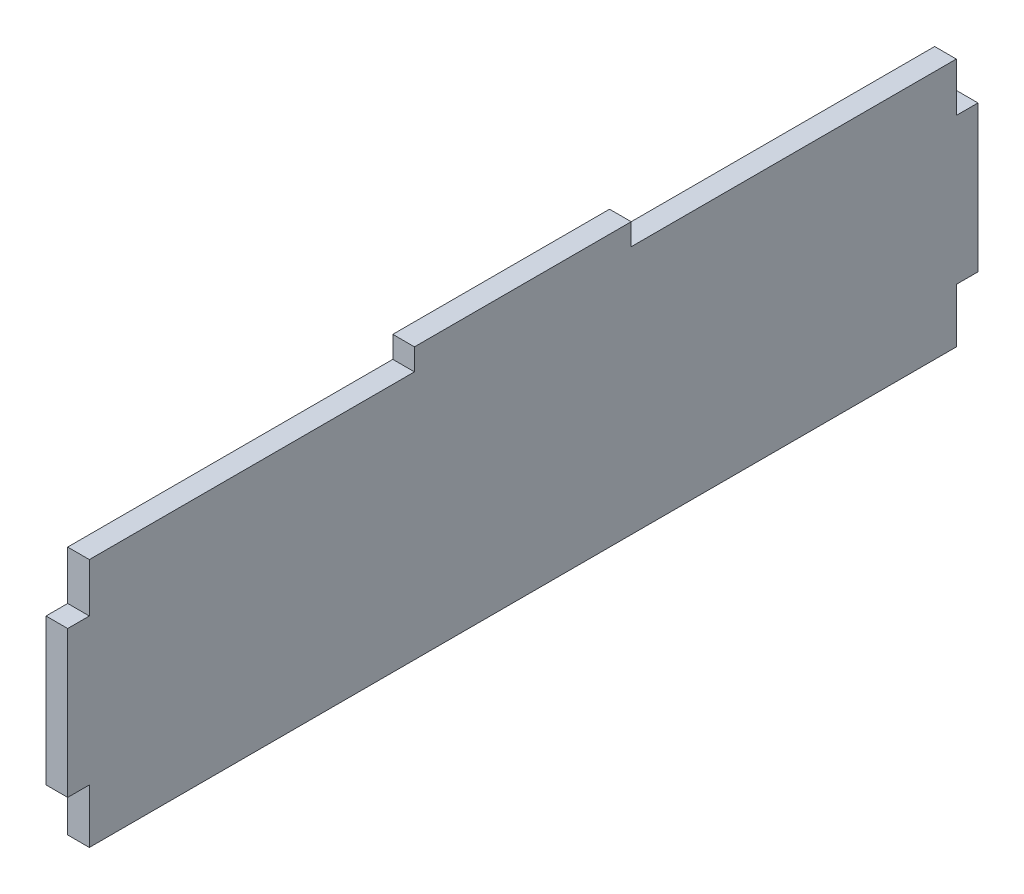
ISO-10303-21;
HEADER;
FILE_DESCRIPTION(('STEP AP214'),'2;1');
FILE_NAME('part.step','',(''),(''),'','','');
FILE_SCHEMA(('AUTOMOTIVE_DESIGN { 1 0 10303 214 1 1 1 1 }'));
ENDSEC;
DATA;
#1=APPLICATION_CONTEXT('core data for automotive mechanical design processes');
#2=APPLICATION_PROTOCOL_DEFINITION('international standard','automotive_design',2000,#1);
#3=PRODUCT_CONTEXT('',#1,'mechanical');
#4=PRODUCT('Part','Part','',(#3));
#5=PRODUCT_RELATED_PRODUCT_CATEGORY('part','',(#4));
#6=PRODUCT_DEFINITION_FORMATION('','',#4);
#7=PRODUCT_DEFINITION_CONTEXT('part definition',#1,'design');
#8=PRODUCT_DEFINITION('design','',#6,#7);
#9=PRODUCT_DEFINITION_SHAPE('','',#8);
#10=(LENGTH_UNIT() NAMED_UNIT(*) SI_UNIT(.MILLI.,.METRE.));
#11=(NAMED_UNIT(*) PLANE_ANGLE_UNIT() SI_UNIT($,.RADIAN.));
#12=(NAMED_UNIT(*) SI_UNIT($,.STERADIAN.) SOLID_ANGLE_UNIT());
#13=UNCERTAINTY_MEASURE_WITH_UNIT(LENGTH_MEASURE(1.E-05),#10,'distance_accuracy_value','');
#14=(GEOMETRIC_REPRESENTATION_CONTEXT(3) GLOBAL_UNCERTAINTY_ASSIGNED_CONTEXT((#13)) GLOBAL_UNIT_ASSIGNED_CONTEXT((#10,
#11,#12)) REPRESENTATION_CONTEXT('',''));
#15=CARTESIAN_POINT('',(0.,0.,0.));
#16=DIRECTION('',(0.,0.,1.));
#17=DIRECTION('',(1.,0.,0.));
#18=AXIS2_PLACEMENT_3D('',#15,#16,#17);
#19=CARTESIAN_POINT('',(4.,-0.984599978801032,-1.));
#20=DIRECTION('',(0.,0.,-1.));
#21=DIRECTION('',(0.,1.,0.));
#22=AXIS2_PLACEMENT_3D('',#19,#20,#21);
#23=PLANE('',#22);
#24=DIRECTION('',(0.,-1.,0.));
#25=VECTOR('',#24,1.);
#26=CARTESIAN_POINT('',(0.,-0.984599978801032,-1.));
#27=LINE('',#26,#25);
#28=CARTESIAN_POINT('',(0.,-0.984599978801032,-1.));
#29=VERTEX_POINT('',#28);
#30=CARTESIAN_POINT('',(0.,-10.,-1.));
#31=VERTEX_POINT('',#30);
#32=EDGE_CURVE('E198',#29,#31,#27,.T.);
#33=ORIENTED_EDGE('',*,*,#32,.T.);
#34=DIRECTION('',(-1.,0.,0.));
#35=VECTOR('',#34,1.);
#36=CARTESIAN_POINT('',(4.,-10.,-1.));
#37=LINE('',#36,#35);
#38=CARTESIAN_POINT('',(4.,-10.,-1.));
#39=VERTEX_POINT('',#38);
#40=EDGE_CURVE('E11',#39,#31,#37,.T.);
#41=ORIENTED_EDGE('',*,*,#40,.F.);
#42=DIRECTION('',(0.,-1.,0.));
#43=VECTOR('',#42,1.);
#44=CARTESIAN_POINT('',(4.,-0.984599978801032,-1.));
#45=LINE('',#44,#43);
#46=CARTESIAN_POINT('',(4.,-0.984599978801032,-1.));
#47=VERTEX_POINT('',#46);
#48=EDGE_CURVE('E244',#47,#39,#45,.T.);
#49=ORIENTED_EDGE('',*,*,#48,.F.);
#50=DIRECTION('',(-1.,0.,0.));
#51=VECTOR('',#50,1.);
#52=CARTESIAN_POINT('',(4.,-0.984599978801032,-1.));
#53=LINE('',#52,#51);
#54=EDGE_CURVE('E194',#47,#29,#53,.T.);
#55=ORIENTED_EDGE('',*,*,#54,.T.);
#56=EDGE_LOOP('',(#33,#41,#49,#55));
#57=FACE_BOUND('',#56,.T.);
#58=ADVANCED_FACE('F49',(#57),#23,.F.);
#59=CARTESIAN_POINT('',(4.,-10.,3.));
#60=DIRECTION('',(0.,-1.,0.));
#61=DIRECTION('',(0.,0.,-1.));
#62=AXIS2_PLACEMENT_3D('',#59,#60,#61);
#63=PLANE('',#62);
#64=DIRECTION('',(0.,0.,1.));
#65=VECTOR('',#64,1.);
#66=CARTESIAN_POINT('',(0.,-10.,3.));
#67=LINE('',#66,#65);
#68=CARTESIAN_POINT('',(0.,-10.,3.));
#69=VERTEX_POINT('',#68);
#70=EDGE_CURVE('E202',#31,#69,#67,.T.);
#71=ORIENTED_EDGE('',*,*,#70,.T.);
#72=DIRECTION('',(-1.,0.,0.));
#73=VECTOR('',#72,1.);
#74=CARTESIAN_POINT('',(4.,-10.,3.));
#75=LINE('',#74,#73);
#76=CARTESIAN_POINT('',(4.,-10.,3.));
#77=VERTEX_POINT('',#76);
#78=EDGE_CURVE('E58',#77,#69,#75,.T.);
#79=ORIENTED_EDGE('',*,*,#78,.F.);
#80=DIRECTION('',(0.,0.,1.));
#81=VECTOR('',#80,1.);
#82=CARTESIAN_POINT('',(4.,-10.,3.));
#83=LINE('',#82,#81);
#84=EDGE_CURVE('E133',#39,#77,#83,.T.);
#85=ORIENTED_EDGE('',*,*,#84,.F.);
#86=ORIENTED_EDGE('',*,*,#40,.T.);
#87=EDGE_LOOP('',(#71,#79,#85,#86));
#88=FACE_BOUND('',#87,.T.);
#89=ADVANCED_FACE('F366',(#88),#63,.F.);
#90=CARTESIAN_POINT('',(4.,-10.,3.));
#91=DIRECTION('',(0.,0.,-1.));
#92=DIRECTION('',(0.,1.,0.));
#93=AXIS2_PLACEMENT_3D('',#90,#91,#92);
#94=PLANE('',#93);
#95=DIRECTION('',(0.,-1.,0.));
#96=VECTOR('',#95,1.);
#97=CARTESIAN_POINT('',(0.,-10.,3.));
#98=LINE('',#97,#96);
#99=CARTESIAN_POINT('',(0.,-37.,2.99999999999999));
#100=VERTEX_POINT('',#99);
#101=EDGE_CURVE('E205',#69,#100,#98,.T.);
#102=ORIENTED_EDGE('',*,*,#101,.T.);
#103=DIRECTION('',(-1.,0.,0.));
#104=VECTOR('',#103,1.);
#105=CARTESIAN_POINT('',(4.,-37.,2.99999999999999));
#106=LINE('',#105,#104);
#107=CARTESIAN_POINT('',(4.,-37.,2.99999999999999));
#108=VERTEX_POINT('',#107);
#109=EDGE_CURVE('E287',#108,#100,#106,.T.);
#110=ORIENTED_EDGE('',*,*,#109,.F.);
#111=DIRECTION('',(0.,-1.,0.));
#112=VECTOR('',#111,1.);
#113=CARTESIAN_POINT('',(4.,-10.,3.));
#114=LINE('',#113,#112);
#115=EDGE_CURVE('E297',#77,#108,#114,.T.);
#116=ORIENTED_EDGE('',*,*,#115,.F.);
#117=ORIENTED_EDGE('',*,*,#78,.T.);
#118=EDGE_LOOP('',(#102,#110,#116,#117));
#119=FACE_BOUND('',#118,.T.);
#120=ADVANCED_FACE('F295',(#119),#94,.F.);
#121=CARTESIAN_POINT('',(4.,-37.,2.99999999999999));
#122=DIRECTION('',(0.,1.,0.));
#123=DIRECTION('',(0.,0.,1.));
#124=AXIS2_PLACEMENT_3D('',#121,#122,#123);
#125=PLANE('',#124);
#126=DIRECTION('',(0.,0.,-1.));
#127=VECTOR('',#126,1.);
#128=CARTESIAN_POINT('',(0.,-37.,2.99999999999999));
#129=LINE('',#128,#127);
#130=CARTESIAN_POINT('',(0.,-37.,-1.00000000000001));
#131=VERTEX_POINT('',#130);
#132=EDGE_CURVE('E208',#100,#131,#129,.T.);
#133=ORIENTED_EDGE('',*,*,#132,.T.);
#134=DIRECTION('',(-1.,0.,0.));
#135=VECTOR('',#134,1.);
#136=CARTESIAN_POINT('',(4.,-37.,-1.00000000000001));
#137=LINE('',#136,#135);
#138=CARTESIAN_POINT('',(4.,-37.,-1.00000000000001));
#139=VERTEX_POINT('',#138);
#140=EDGE_CURVE('E283',#139,#131,#137,.T.);
#141=ORIENTED_EDGE('',*,*,#140,.F.);
#142=DIRECTION('',(0.,0.,-1.));
#143=VECTOR('',#142,1.);
#144=CARTESIAN_POINT('',(4.,-37.,2.99999999999999));
#145=LINE('',#144,#143);
#146=EDGE_CURVE('E316',#108,#139,#145,.T.);
#147=ORIENTED_EDGE('',*,*,#146,.F.);
#148=ORIENTED_EDGE('',*,*,#109,.T.);
#149=EDGE_LOOP('',(#133,#141,#147,#148));
#150=FACE_BOUND('',#149,.T.);
#151=ADVANCED_FACE('F306',(#150),#125,.F.);
#152=CARTESIAN_POINT('',(4.,-37.,-1.00000000000001));
#153=DIRECTION('',(0.,0.,-1.));
#154=DIRECTION('',(0.,1.,0.));
#155=AXIS2_PLACEMENT_3D('',#152,#153,#154);
#156=PLANE('',#155);
#157=DIRECTION('',(0.,-1.,0.));
#158=VECTOR('',#157,1.);
#159=CARTESIAN_POINT('',(0.,-37.,-1.00000000000001));
#160=LINE('',#159,#158);
#161=CARTESIAN_POINT('',(0.,-47.,-1.00000000000001));
#162=VERTEX_POINT('',#161);
#163=EDGE_CURVE('E211',#131,#162,#160,.T.);
#164=ORIENTED_EDGE('',*,*,#163,.T.);
#165=DIRECTION('',(-1.,0.,0.));
#166=VECTOR('',#165,1.);
#167=CARTESIAN_POINT('',(4.,-47.,-1.00000000000001));
#168=LINE('',#167,#166);
#169=CARTESIAN_POINT('',(4.,-47.,-1.00000000000001));
#170=VERTEX_POINT('',#169);
#171=EDGE_CURVE('E279',#170,#162,#168,.T.);
#172=ORIENTED_EDGE('',*,*,#171,.F.);
#173=DIRECTION('',(0.,-1.,0.));
#174=VECTOR('',#173,1.);
#175=CARTESIAN_POINT('',(4.,-37.,-1.00000000000001));
#176=LINE('',#175,#174);
#177=EDGE_CURVE('E312',#139,#170,#176,.T.);
#178=ORIENTED_EDGE('',*,*,#177,.F.);
#179=ORIENTED_EDGE('',*,*,#140,.T.);
#180=EDGE_LOOP('',(#164,#172,#178,#179));
#181=FACE_BOUND('',#180,.T.);
#182=ADVANCED_FACE('F310',(#181),#156,.F.);
#183=CARTESIAN_POINT('',(4.,-47.,-1.00000000000001));
#184=DIRECTION('',(0.,1.,0.));
#185=DIRECTION('',(0.,0.,1.));
#186=AXIS2_PLACEMENT_3D('',#183,#184,#185);
#187=PLANE('',#186);
#188=DIRECTION('',(0.,0.,-1.));
#189=VECTOR('',#188,1.);
#190=CARTESIAN_POINT('',(0.,-47.,-1.00000000000001));
#191=LINE('',#190,#189);
#192=CARTESIAN_POINT('',(0.,-47.,-161.));
#193=VERTEX_POINT('',#192);
#194=EDGE_CURVE('E214',#162,#193,#191,.T.);
#195=ORIENTED_EDGE('',*,*,#194,.T.);
#196=DIRECTION('',(-1.,0.,0.));
#197=VECTOR('',#196,1.);
#198=CARTESIAN_POINT('',(4.,-47.,-161.));
#199=LINE('',#198,#197);
#200=CARTESIAN_POINT('',(4.,-47.,-161.));
#201=VERTEX_POINT('',#200);
#202=EDGE_CURVE('E275',#201,#193,#199,.T.);
#203=ORIENTED_EDGE('',*,*,#202,.F.);
#204=DIRECTION('',(0.,0.,-1.));
#205=VECTOR('',#204,1.);
#206=CARTESIAN_POINT('',(4.,-47.,-1.00000000000001));
#207=LINE('',#206,#205);
#208=EDGE_CURVE('E315',#170,#201,#207,.T.);
#209=ORIENTED_EDGE('',*,*,#208,.F.);
#210=ORIENTED_EDGE('',*,*,#171,.T.);
#211=EDGE_LOOP('',(#195,#203,#209,#210));
#212=FACE_BOUND('',#211,.T.);
#213=ADVANCED_FACE('F379',(#212),#187,.F.);
#214=CARTESIAN_POINT('',(4.,-37.,-161.));
#215=DIRECTION('',(0.,0.,1.));
#216=DIRECTION('',(1.,0.,0.));
#217=AXIS2_PLACEMENT_3D('',#214,#215,#216);
#218=PLANE('',#217);
#219=DIRECTION('',(0.,1.,0.));
#220=VECTOR('',#219,1.);
#221=CARTESIAN_POINT('',(0.,-37.,-161.));
#222=LINE('',#221,#220);
#223=CARTESIAN_POINT('',(0.,-37.,-161.));
#224=VERTEX_POINT('',#223);
#225=EDGE_CURVE('E217',#193,#224,#222,.T.);
#226=ORIENTED_EDGE('',*,*,#225,.T.);
#227=DIRECTION('',(-1.,0.,0.));
#228=VECTOR('',#227,1.);
#229=CARTESIAN_POINT('',(4.,-37.,-161.));
#230=LINE('',#229,#228);
#231=CARTESIAN_POINT('',(4.,-37.,-161.));
#232=VERTEX_POINT('',#231);
#233=EDGE_CURVE('E271',#232,#224,#230,.T.);
#234=ORIENTED_EDGE('',*,*,#233,.F.);
#235=DIRECTION('',(0.,1.,0.));
#236=VECTOR('',#235,1.);
#237=CARTESIAN_POINT('',(4.,-37.,-161.));
#238=LINE('',#237,#236);
#239=EDGE_CURVE('E320',#201,#232,#238,.T.);
#240=ORIENTED_EDGE('',*,*,#239,.F.);
#241=ORIENTED_EDGE('',*,*,#202,.T.);
#242=EDGE_LOOP('',(#226,#234,#240,#241));
#243=FACE_BOUND('',#242,.T.);
#244=ADVANCED_FACE('F382',(#243),#218,.F.);
#245=CARTESIAN_POINT('',(4.,-37.,-165.));
#246=DIRECTION('',(0.,1.,0.));
#247=DIRECTION('',(0.,0.,1.));
#248=AXIS2_PLACEMENT_3D('',#245,#246,#247);
#249=PLANE('',#248);
#250=DIRECTION('',(0.,0.,-1.));
#251=VECTOR('',#250,1.);
#252=CARTESIAN_POINT('',(0.,-37.,-165.));
#253=LINE('',#252,#251);
#254=CARTESIAN_POINT('',(0.,-37.,-165.));
#255=VERTEX_POINT('',#254);
#256=EDGE_CURVE('E220',#224,#255,#253,.T.);
#257=ORIENTED_EDGE('',*,*,#256,.T.);
#258=DIRECTION('',(-1.,0.,0.));
#259=VECTOR('',#258,1.);
#260=CARTESIAN_POINT('',(4.,-37.,-165.));
#261=LINE('',#260,#259);
#262=CARTESIAN_POINT('',(4.,-37.,-165.));
#263=VERTEX_POINT('',#262);
#264=EDGE_CURVE('E267',#263,#255,#261,.T.);
#265=ORIENTED_EDGE('',*,*,#264,.F.);
#266=DIRECTION('',(0.,0.,-1.));
#267=VECTOR('',#266,1.);
#268=CARTESIAN_POINT('',(4.,-37.,-165.));
#269=LINE('',#268,#267);
#270=EDGE_CURVE('E327',#232,#263,#269,.T.);
#271=ORIENTED_EDGE('',*,*,#270,.F.);
#272=ORIENTED_EDGE('',*,*,#233,.T.);
#273=EDGE_LOOP('',(#257,#265,#271,#272));
#274=FACE_BOUND('',#273,.T.);
#275=ADVANCED_FACE('F386',(#274),#249,.F.);
#276=CARTESIAN_POINT('',(4.,-10.,-165.));
#277=DIRECTION('',(0.,0.,1.));
#278=DIRECTION('',(1.,0.,0.));
#279=AXIS2_PLACEMENT_3D('',#276,#277,#278);
#280=PLANE('',#279);
#281=DIRECTION('',(0.,1.,0.));
#282=VECTOR('',#281,1.);
#283=CARTESIAN_POINT('',(0.,-10.,-165.));
#284=LINE('',#283,#282);
#285=CARTESIAN_POINT('',(0.,-10.,-165.));
#286=VERTEX_POINT('',#285);
#287=EDGE_CURVE('E223',#255,#286,#284,.T.);
#288=ORIENTED_EDGE('',*,*,#287,.T.);
#289=DIRECTION('',(-1.,0.,0.));
#290=VECTOR('',#289,1.);
#291=CARTESIAN_POINT('',(4.,-10.,-165.));
#292=LINE('',#291,#290);
#293=CARTESIAN_POINT('',(4.,-10.,-165.));
#294=VERTEX_POINT('',#293);
#295=EDGE_CURVE('E263',#294,#286,#292,.T.);
#296=ORIENTED_EDGE('',*,*,#295,.F.);
#297=DIRECTION('',(0.,1.,0.));
#298=VECTOR('',#297,1.);
#299=CARTESIAN_POINT('',(4.,-10.,-165.));
#300=LINE('',#299,#298);
#301=EDGE_CURVE('E330',#263,#294,#300,.T.);
#302=ORIENTED_EDGE('',*,*,#301,.F.);
#303=ORIENTED_EDGE('',*,*,#264,.T.);
#304=EDGE_LOOP('',(#288,#296,#302,#303));
#305=FACE_BOUND('',#304,.T.);
#306=ADVANCED_FACE('F390',(#305),#280,.F.);
#307=CARTESIAN_POINT('',(4.,-10.,-165.));
#308=DIRECTION('',(0.,-1.,0.));
#309=DIRECTION('',(0.,0.,-1.));
#310=AXIS2_PLACEMENT_3D('',#307,#308,#309);
#311=PLANE('',#310);
#312=DIRECTION('',(0.,0.,1.));
#313=VECTOR('',#312,1.);
#314=CARTESIAN_POINT('',(0.,-10.,-165.));
#315=LINE('',#314,#313);
#316=CARTESIAN_POINT('',(0.,-10.,-161.));
#317=VERTEX_POINT('',#316);
#318=EDGE_CURVE('E226',#286,#317,#315,.T.);
#319=ORIENTED_EDGE('',*,*,#318,.T.);
#320=DIRECTION('',(-1.,0.,0.));
#321=VECTOR('',#320,1.);
#322=CARTESIAN_POINT('',(4.,-10.,-161.));
#323=LINE('',#322,#321);
#324=CARTESIAN_POINT('',(4.,-10.,-161.));
#325=VERTEX_POINT('',#324);
#326=EDGE_CURVE('E259',#325,#317,#323,.T.);
#327=ORIENTED_EDGE('',*,*,#326,.F.);
#328=DIRECTION('',(0.,0.,1.));
#329=VECTOR('',#328,1.);
#330=CARTESIAN_POINT('',(4.,-10.,-165.));
#331=LINE('',#330,#329);
#332=EDGE_CURVE('E333',#294,#325,#331,.T.);
#333=ORIENTED_EDGE('',*,*,#332,.F.);
#334=ORIENTED_EDGE('',*,*,#295,.T.);
#335=EDGE_LOOP('',(#319,#327,#333,#334));
#336=FACE_BOUND('',#335,.T.);
#337=ADVANCED_FACE('F394',(#336),#311,.F.);
#338=CARTESIAN_POINT('',(4.,-0.984599978801032,-161.));
#339=DIRECTION('',(0.,0.,1.));
#340=DIRECTION('',(1.,0.,0.));
#341=AXIS2_PLACEMENT_3D('',#338,#339,#340);
#342=PLANE('',#341);
#343=DIRECTION('',(0.,1.,0.));
#344=VECTOR('',#343,1.);
#345=CARTESIAN_POINT('',(0.,-0.984599978801032,-161.));
#346=LINE('',#345,#344);
#347=CARTESIAN_POINT('',(0.,-0.984599978801032,-161.));
#348=VERTEX_POINT('',#347);
#349=EDGE_CURVE('E229',#317,#348,#346,.T.);
#350=ORIENTED_EDGE('',*,*,#349,.T.);
#351=DIRECTION('',(-1.,0.,0.));
#352=VECTOR('',#351,1.);
#353=CARTESIAN_POINT('',(4.,-0.984599978801032,-161.));
#354=LINE('',#353,#352);
#355=CARTESIAN_POINT('',(4.,-0.984599978801032,-161.));
#356=VERTEX_POINT('',#355);
#357=EDGE_CURVE('E255',#356,#348,#354,.T.);
#358=ORIENTED_EDGE('',*,*,#357,.F.);
#359=DIRECTION('',(0.,1.,0.));
#360=VECTOR('',#359,1.);
#361=CARTESIAN_POINT('',(4.,-0.984599978801032,-161.));
#362=LINE('',#361,#360);
#363=EDGE_CURVE('E336',#325,#356,#362,.T.);
#364=ORIENTED_EDGE('',*,*,#363,.F.);
#365=ORIENTED_EDGE('',*,*,#326,.T.);
#366=EDGE_LOOP('',(#350,#358,#364,#365));
#367=FACE_BOUND('',#366,.T.);
#368=ADVANCED_FACE('F398',(#367),#342,.F.);
#369=CARTESIAN_POINT('',(4.,-0.984599978801032,-101.));
#370=DIRECTION('',(0.,-1.,0.));
#371=DIRECTION('',(0.,0.,-1.));
#372=AXIS2_PLACEMENT_3D('',#369,#370,#371);
#373=PLANE('',#372);
#374=DIRECTION('',(0.,0.,1.));
#375=VECTOR('',#374,1.);
#376=CARTESIAN_POINT('',(0.,-0.984599978801032,-101.));
#377=LINE('',#376,#375);
#378=CARTESIAN_POINT('',(0.,-0.984599978801032,-101.));
#379=VERTEX_POINT('',#378);
#380=EDGE_CURVE('E232',#348,#379,#377,.T.);
#381=ORIENTED_EDGE('',*,*,#380,.T.);
#382=DIRECTION('',(-1.,0.,0.));
#383=VECTOR('',#382,1.);
#384=CARTESIAN_POINT('',(4.,-0.984599978801032,-101.));
#385=LINE('',#384,#383);
#386=CARTESIAN_POINT('',(4.,-0.984599978801032,-101.));
#387=VERTEX_POINT('',#386);
#388=EDGE_CURVE('E251',#387,#379,#385,.T.);
#389=ORIENTED_EDGE('',*,*,#388,.F.);
#390=DIRECTION('',(0.,0.,1.));
#391=VECTOR('',#390,1.);
#392=CARTESIAN_POINT('',(4.,-0.984599978801032,-101.));
#393=LINE('',#392,#391);
#394=EDGE_CURVE('E339',#356,#387,#393,.T.);
#395=ORIENTED_EDGE('',*,*,#394,.F.);
#396=ORIENTED_EDGE('',*,*,#357,.T.);
#397=EDGE_LOOP('',(#381,#389,#395,#396));
#398=FACE_BOUND('',#397,.T.);
#399=ADVANCED_FACE('F347',(#398),#373,.F.);
#400=CARTESIAN_POINT('',(4.,3.01540002119897,-101.));
#401=DIRECTION('',(0.,0.,1.));
#402=DIRECTION('',(1.,0.,0.));
#403=AXIS2_PLACEMENT_3D('',#400,#401,#402);
#404=PLANE('',#403);
#405=DIRECTION('',(0.,1.,0.));
#406=VECTOR('',#405,1.);
#407=CARTESIAN_POINT('',(0.,3.01540002119897,-101.));
#408=LINE('',#407,#406);
#409=CARTESIAN_POINT('',(0.,3.01540002119897,-101.));
#410=VERTEX_POINT('',#409);
#411=EDGE_CURVE('E235',#379,#410,#408,.T.);
#412=ORIENTED_EDGE('',*,*,#411,.T.);
#413=DIRECTION('',(-1.,0.,0.));
#414=VECTOR('',#413,1.);
#415=CARTESIAN_POINT('',(4.,3.01540002119897,-101.));
#416=LINE('',#415,#414);
#417=CARTESIAN_POINT('',(4.,3.01540002119897,-101.));
#418=VERTEX_POINT('',#417);
#419=EDGE_CURVE('E187',#418,#410,#416,.T.);
#420=ORIENTED_EDGE('',*,*,#419,.F.);
#421=DIRECTION('',(0.,1.,0.));
#422=VECTOR('',#421,1.);
#423=CARTESIAN_POINT('',(4.,3.01540002119897,-101.));
#424=LINE('',#423,#422);
#425=EDGE_CURVE('E176',#387,#418,#424,.T.);
#426=ORIENTED_EDGE('',*,*,#425,.F.);
#427=ORIENTED_EDGE('',*,*,#388,.T.);
#428=EDGE_LOOP('',(#412,#420,#426,#427));
#429=FACE_BOUND('',#428,.T.);
#430=ADVANCED_FACE('F351',(#429),#404,.F.);
#431=CARTESIAN_POINT('',(4.,3.01540002119897,-61.));
#432=DIRECTION('',(0.,-1.,0.));
#433=DIRECTION('',(0.,0.,-1.));
#434=AXIS2_PLACEMENT_3D('',#431,#432,#433);
#435=PLANE('',#434);
#436=DIRECTION('',(0.,0.,1.));
#437=VECTOR('',#436,1.);
#438=CARTESIAN_POINT('',(0.,3.01540002119897,-61.));
#439=LINE('',#438,#437);
#440=CARTESIAN_POINT('',(0.,3.01540002119897,-61.));
#441=VERTEX_POINT('',#440);
#442=EDGE_CURVE('E185',#410,#441,#439,.T.);
#443=ORIENTED_EDGE('',*,*,#442,.T.);
#444=DIRECTION('',(-1.,0.,0.));
#445=VECTOR('',#444,1.);
#446=CARTESIAN_POINT('',(4.,3.01540002119897,-61.));
#447=LINE('',#446,#445);
#448=CARTESIAN_POINT('',(4.,3.01540002119897,-61.));
#449=VERTEX_POINT('',#448);
#450=EDGE_CURVE('E182',#449,#441,#447,.T.);
#451=ORIENTED_EDGE('',*,*,#450,.F.);
#452=DIRECTION('',(0.,0.,1.));
#453=VECTOR('',#452,1.);
#454=CARTESIAN_POINT('',(4.,3.01540002119897,-61.));
#455=LINE('',#454,#453);
#456=EDGE_CURVE('E170',#418,#449,#455,.T.);
#457=ORIENTED_EDGE('',*,*,#456,.F.);
#458=ORIENTED_EDGE('',*,*,#419,.T.);
#459=EDGE_LOOP('',(#443,#451,#457,#458));
#460=FACE_BOUND('',#459,.T.);
#461=ADVANCED_FACE('F183',(#460),#435,.F.);
#462=CARTESIAN_POINT('',(4.,3.01540002119897,-61.));
#463=DIRECTION('',(0.,0.,-1.));
#464=DIRECTION('',(-1.,0.,0.));
#465=AXIS2_PLACEMENT_3D('',#462,#463,#464);
#466=PLANE('',#465);
#467=DIRECTION('',(0.,-1.,0.));
#468=VECTOR('',#467,1.);
#469=CARTESIAN_POINT('',(0.,3.01540002119897,-61.));
#470=LINE('',#469,#468);
#471=CARTESIAN_POINT('',(0.,-0.984599978801032,-61.));
#472=VERTEX_POINT('',#471);
#473=EDGE_CURVE('E119',#441,#472,#470,.T.);
#474=ORIENTED_EDGE('',*,*,#473,.T.);
#475=DIRECTION('',(-1.,0.,0.));
#476=VECTOR('',#475,1.);
#477=CARTESIAN_POINT('',(4.,-0.984599978801032,-61.));
#478=LINE('',#477,#476);
#479=CARTESIAN_POINT('',(4.,-0.984599978801032,-61.));
#480=VERTEX_POINT('',#479);
#481=EDGE_CURVE('E188',#480,#472,#478,.T.);
#482=ORIENTED_EDGE('',*,*,#481,.F.);
#483=DIRECTION('',(0.,-1.,0.));
#484=VECTOR('',#483,1.);
#485=CARTESIAN_POINT('',(4.,3.01540002119897,-61.));
#486=LINE('',#485,#484);
#487=EDGE_CURVE('E174',#449,#480,#486,.T.);
#488=ORIENTED_EDGE('',*,*,#487,.F.);
#489=ORIENTED_EDGE('',*,*,#450,.T.);
#490=EDGE_LOOP('',(#474,#482,#488,#489));
#491=FACE_BOUND('',#490,.T.);
#492=ADVANCED_FACE('F190',(#491),#466,.F.);
#493=CARTESIAN_POINT('',(4.,-0.984599978801032,-1.));
#494=DIRECTION('',(0.,-1.,0.));
#495=DIRECTION('',(0.,0.,-1.));
#496=AXIS2_PLACEMENT_3D('',#493,#494,#495);
#497=PLANE('',#496);
#498=DIRECTION('',(0.,0.,1.));
#499=VECTOR('',#498,1.);
#500=CARTESIAN_POINT('',(0.,-0.984599978801032,-1.));
#501=LINE('',#500,#499);
#502=EDGE_CURVE('E125',#472,#29,#501,.T.);
#503=ORIENTED_EDGE('',*,*,#502,.T.);
#504=ORIENTED_EDGE('',*,*,#54,.F.);
#505=DIRECTION('',(0.,0.,1.));
#506=VECTOR('',#505,1.);
#507=CARTESIAN_POINT('',(4.,-0.984599978801032,-1.));
#508=LINE('',#507,#506);
#509=EDGE_CURVE('E66',#480,#47,#508,.T.);
#510=ORIENTED_EDGE('',*,*,#509,.F.);
#511=ORIENTED_EDGE('',*,*,#481,.T.);
#512=EDGE_LOOP('',(#503,#504,#510,#511));
#513=FACE_BOUND('',#512,.T.);
#514=ADVANCED_FACE('F355',(#513),#497,.F.);
#515=CARTESIAN_POINT('',(4.,0.,0.));
#516=DIRECTION('',(1.,0.,0.));
#517=DIRECTION('',(0.,0.,-1.));
#518=AXIS2_PLACEMENT_3D('',#515,#516,#517);
#519=PLANE('',#518);
#520=ORIENTED_EDGE('',*,*,#48,.T.);
#521=ORIENTED_EDGE('',*,*,#84,.T.);
#522=ORIENTED_EDGE('',*,*,#115,.T.);
#523=ORIENTED_EDGE('',*,*,#146,.T.);
#524=ORIENTED_EDGE('',*,*,#177,.T.);
#525=ORIENTED_EDGE('',*,*,#208,.T.);
#526=ORIENTED_EDGE('',*,*,#239,.T.);
#527=ORIENTED_EDGE('',*,*,#270,.T.);
#528=ORIENTED_EDGE('',*,*,#301,.T.);
#529=ORIENTED_EDGE('',*,*,#332,.T.);
#530=ORIENTED_EDGE('',*,*,#363,.T.);
#531=ORIENTED_EDGE('',*,*,#394,.T.);
#532=ORIENTED_EDGE('',*,*,#425,.T.);
#533=ORIENTED_EDGE('',*,*,#456,.T.);
#534=ORIENTED_EDGE('',*,*,#487,.T.);
#535=ORIENTED_EDGE('',*,*,#509,.T.);
#536=EDGE_LOOP('',(#520,#521,#522,#523,#524,#525,#526,#527,#528,#529,#530,#531,#532,#533,#534,#535));
#537=FACE_BOUND('',#536,.T.);
#538=ADVANCED_FACE('F172',(#537),#519,.T.);
#539=CARTESIAN_POINT('',(0.,0.,0.));
#540=DIRECTION('',(1.,0.,0.));
#541=DIRECTION('',(0.,0.,-1.));
#542=AXIS2_PLACEMENT_3D('',#539,#540,#541);
#543=PLANE('',#542);
#544=ORIENTED_EDGE('',*,*,#32,.F.);
#545=ORIENTED_EDGE('',*,*,#502,.F.);
#546=ORIENTED_EDGE('',*,*,#473,.F.);
#547=ORIENTED_EDGE('',*,*,#442,.F.);
#548=ORIENTED_EDGE('',*,*,#411,.F.);
#549=ORIENTED_EDGE('',*,*,#380,.F.);
#550=ORIENTED_EDGE('',*,*,#349,.F.);
#551=ORIENTED_EDGE('',*,*,#318,.F.);
#552=ORIENTED_EDGE('',*,*,#287,.F.);
#553=ORIENTED_EDGE('',*,*,#256,.F.);
#554=ORIENTED_EDGE('',*,*,#225,.F.);
#555=ORIENTED_EDGE('',*,*,#194,.F.);
#556=ORIENTED_EDGE('',*,*,#163,.F.);
#557=ORIENTED_EDGE('',*,*,#132,.F.);
#558=ORIENTED_EDGE('',*,*,#101,.F.);
#559=ORIENTED_EDGE('',*,*,#70,.F.);
#560=EDGE_LOOP('',(#544,#545,#546,#547,#548,#549,#550,#551,#552,#553,#554,#555,#556,#557,#558,#559));
#561=FACE_BOUND('',#560,.T.);
#562=ADVANCED_FACE('F301',(#561),#543,.F.);
#563=CLOSED_SHELL('',(#58,#89,#120,#151,#182,#213,#244,#275,#306,#337,#368,#399,#430,#461,#492,
#514,#538,#562));
#564=MANIFOLD_SOLID_BREP('B2',#563);
#565=ADVANCED_BREP_SHAPE_REPRESENTATION('',(#18,#564),#14);
#566=SHAPE_DEFINITION_REPRESENTATION(#9,#565);
ENDSEC;
END-ISO-10303-21;
